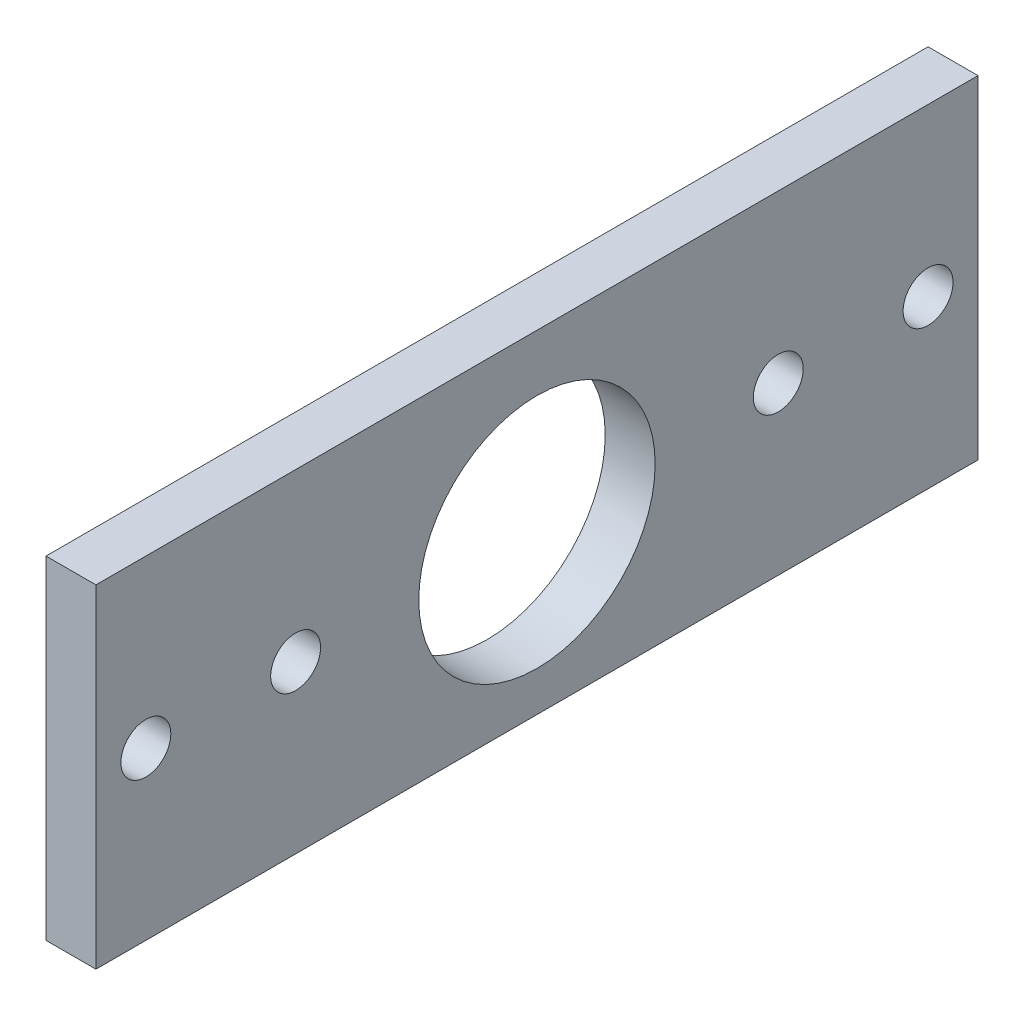
ISO-10303-21;
HEADER;
FILE_DESCRIPTION(('STEP AP214'),'2;1');
FILE_NAME('part.step','',(''),(''),'','','');
FILE_SCHEMA(('AUTOMOTIVE_DESIGN { 1 0 10303 214 1 1 1 1 }'));
ENDSEC;
DATA;
#1=APPLICATION_CONTEXT('core data for automotive mechanical design processes');
#2=APPLICATION_PROTOCOL_DEFINITION('international standard','automotive_design',2000,#1);
#3=PRODUCT_CONTEXT('',#1,'mechanical');
#4=PRODUCT('Part','Part','',(#3));
#5=PRODUCT_RELATED_PRODUCT_CATEGORY('part','',(#4));
#6=PRODUCT_DEFINITION_FORMATION('','',#4);
#7=PRODUCT_DEFINITION_CONTEXT('part definition',#1,'design');
#8=PRODUCT_DEFINITION('design','',#6,#7);
#9=PRODUCT_DEFINITION_SHAPE('','',#8);
#10=(LENGTH_UNIT() NAMED_UNIT(*) SI_UNIT(.MILLI.,.METRE.));
#11=(NAMED_UNIT(*) PLANE_ANGLE_UNIT() SI_UNIT($,.RADIAN.));
#12=(NAMED_UNIT(*) SI_UNIT($,.STERADIAN.) SOLID_ANGLE_UNIT());
#13=UNCERTAINTY_MEASURE_WITH_UNIT(LENGTH_MEASURE(1.E-05),#10,'distance_accuracy_value','');
#14=(GEOMETRIC_REPRESENTATION_CONTEXT(3) GLOBAL_UNCERTAINTY_ASSIGNED_CONTEXT((#13)) GLOBAL_UNIT_ASSIGNED_CONTEXT((#10,
#11,#12)) REPRESENTATION_CONTEXT('',''));
#15=CARTESIAN_POINT('',(0.,0.,0.));
#16=DIRECTION('',(0.,0.,1.));
#17=DIRECTION('',(1.,0.,0.));
#18=AXIS2_PLACEMENT_3D('',#15,#16,#17);
#19=CARTESIAN_POINT('',(3.,0.,0.));
#20=DIRECTION('',(-1.,0.,0.));
#21=DIRECTION('',(0.,0.,1.));
#22=AXIS2_PLACEMENT_3D('',#19,#20,#21);
#23=PLANE('',#22);
#24=DIRECTION('',(0.,-1.,0.));
#25=VECTOR('',#24,1.);
#26=CARTESIAN_POINT('',(3.,0.,0.));
#27=LINE('',#26,#25);
#28=CARTESIAN_POINT('',(3.,20.,0.));
#29=VERTEX_POINT('',#28);
#30=CARTESIAN_POINT('',(3.,0.,0.));
#31=VERTEX_POINT('',#30);
#32=EDGE_CURVE('E87',#29,#31,#27,.T.);
#33=ORIENTED_EDGE('',*,*,#32,.T.);
#34=DIRECTION('',(0.,0.,-1.));
#35=VECTOR('',#34,1.);
#36=CARTESIAN_POINT('',(3.,0.,0.));
#37=LINE('',#36,#35);
#38=CARTESIAN_POINT('',(3.,0.,-53.));
#39=VERTEX_POINT('',#38);
#40=EDGE_CURVE('E82',#31,#39,#37,.T.);
#41=ORIENTED_EDGE('',*,*,#40,.T.);
#42=DIRECTION('',(0.,1.,0.));
#43=VECTOR('',#42,1.);
#44=CARTESIAN_POINT('',(3.,0.,-53.));
#45=LINE('',#44,#43);
#46=CARTESIAN_POINT('',(3.,20.,-53.));
#47=VERTEX_POINT('',#46);
#48=EDGE_CURVE('E85',#39,#47,#45,.T.);
#49=ORIENTED_EDGE('',*,*,#48,.T.);
#50=DIRECTION('',(0.,0.,1.));
#51=VECTOR('',#50,1.);
#52=CARTESIAN_POINT('',(3.,20.,0.));
#53=LINE('',#52,#51);
#54=EDGE_CURVE('E52',#47,#29,#53,.T.);
#55=ORIENTED_EDGE('',*,*,#54,.T.);
#56=EDGE_LOOP('',(#33,#41,#49,#55));
#57=FACE_BOUND('',#56,.T.);
#58=CARTESIAN_POINT('',(3.,10.,-3.));
#59=DIRECTION('',(1.,0.,0.));
#60=DIRECTION('',(0.,0.,-1.));
#61=AXIS2_PLACEMENT_3D('',#58,#59,#60);
#62=CIRCLE('',#61,1.5);
#63=CARTESIAN_POINT('',(3.,10.,-4.5));
#64=VERTEX_POINT('',#63);
#65=EDGE_CURVE('E102',#64,#64,#62,.T.);
#66=ORIENTED_EDGE('',*,*,#65,.F.);
#67=EDGE_LOOP('',(#66));
#68=FACE_BOUND('',#67,.T.);
#69=CARTESIAN_POINT('',(3.,10.,-12.));
#70=DIRECTION('',(1.,0.,0.));
#71=DIRECTION('',(0.,0.,-1.));
#72=AXIS2_PLACEMENT_3D('',#69,#70,#71);
#73=CIRCLE('',#72,1.5);
#74=CARTESIAN_POINT('',(3.,10.,-13.5));
#75=VERTEX_POINT('',#74);
#76=EDGE_CURVE('E117',#75,#75,#73,.T.);
#77=ORIENTED_EDGE('',*,*,#76,.F.);
#78=EDGE_LOOP('',(#77));
#79=FACE_BOUND('',#78,.T.);
#80=CARTESIAN_POINT('',(3.,9.5,-26.5));
#81=DIRECTION('',(1.,0.,0.));
#82=DIRECTION('',(0.,0.,-1.));
#83=AXIS2_PLACEMENT_3D('',#80,#81,#82);
#84=CIRCLE('',#83,7.10183023594653);
#85=CARTESIAN_POINT('',(3.,9.5,-33.6018302359465));
#86=VERTEX_POINT('',#85);
#87=EDGE_CURVE('E123',#86,#86,#84,.T.);
#88=ORIENTED_EDGE('',*,*,#87,.F.);
#89=EDGE_LOOP('',(#88));
#90=FACE_BOUND('',#89,.T.);
#91=CARTESIAN_POINT('',(3.,10.,-41.));
#92=DIRECTION('',(1.,0.,0.));
#93=DIRECTION('',(0.,0.,1.));
#94=AXIS2_PLACEMENT_3D('',#91,#92,#93);
#95=CIRCLE('',#94,1.5);
#96=CARTESIAN_POINT('',(3.,10.,-39.5));
#97=VERTEX_POINT('',#96);
#98=EDGE_CURVE('E129',#97,#97,#95,.T.);
#99=ORIENTED_EDGE('',*,*,#98,.F.);
#100=EDGE_LOOP('',(#99));
#101=FACE_BOUND('',#100,.T.);
#102=CARTESIAN_POINT('',(3.,10.,-50.));
#103=DIRECTION('',(1.,0.,0.));
#104=DIRECTION('',(0.,0.,1.));
#105=AXIS2_PLACEMENT_3D('',#102,#103,#104);
#106=CIRCLE('',#105,1.5);
#107=CARTESIAN_POINT('',(3.,10.,-48.5));
#108=VERTEX_POINT('',#107);
#109=EDGE_CURVE('E135',#108,#108,#106,.T.);
#110=ORIENTED_EDGE('',*,*,#109,.F.);
#111=EDGE_LOOP('',(#110));
#112=FACE_BOUND('',#111,.T.);
#113=ADVANCED_FACE('F35',(#57,#68,#79,#90,#101,#112),#23,.F.);
#114=CARTESIAN_POINT('',(0.,0.,0.));
#115=DIRECTION('',(-1.,0.,0.));
#116=DIRECTION('',(0.,0.,1.));
#117=AXIS2_PLACEMENT_3D('',#114,#115,#116);
#118=PLANE('',#117);
#119=CARTESIAN_POINT('',(0.,10.,-41.));
#120=DIRECTION('',(1.,0.,0.));
#121=DIRECTION('',(0.,0.,1.));
#122=AXIS2_PLACEMENT_3D('',#119,#120,#121);
#123=CIRCLE('',#122,1.5);
#124=CARTESIAN_POINT('',(0.,10.,-39.5));
#125=VERTEX_POINT('',#124);
#126=EDGE_CURVE('E132',#125,#125,#123,.T.);
#127=ORIENTED_EDGE('',*,*,#126,.T.);
#128=EDGE_LOOP('',(#127));
#129=FACE_BOUND('',#128,.T.);
#130=CARTESIAN_POINT('',(0.,10.,-12.));
#131=DIRECTION('',(1.,0.,0.));
#132=DIRECTION('',(0.,0.,-1.));
#133=AXIS2_PLACEMENT_3D('',#130,#131,#132);
#134=CIRCLE('',#133,1.5);
#135=CARTESIAN_POINT('',(0.,10.,-13.5));
#136=VERTEX_POINT('',#135);
#137=EDGE_CURVE('E120',#136,#136,#134,.T.);
#138=ORIENTED_EDGE('',*,*,#137,.T.);
#139=EDGE_LOOP('',(#138));
#140=FACE_BOUND('',#139,.T.);
#141=DIRECTION('',(0.,-1.,0.));
#142=VECTOR('',#141,1.);
#143=CARTESIAN_POINT('',(0.,0.,0.));
#144=LINE('',#143,#142);
#145=CARTESIAN_POINT('',(0.,20.,0.));
#146=VERTEX_POINT('',#145);
#147=CARTESIAN_POINT('',(0.,0.,0.));
#148=VERTEX_POINT('',#147);
#149=EDGE_CURVE('E99',#146,#148,#144,.T.);
#150=ORIENTED_EDGE('',*,*,#149,.F.);
#151=DIRECTION('',(0.,0.,1.));
#152=VECTOR('',#151,1.);
#153=CARTESIAN_POINT('',(0.,20.,0.));
#154=LINE('',#153,#152);
#155=CARTESIAN_POINT('',(0.,20.,-53.));
#156=VERTEX_POINT('',#155);
#157=EDGE_CURVE('E75',#156,#146,#154,.T.);
#158=ORIENTED_EDGE('',*,*,#157,.F.);
#159=DIRECTION('',(0.,1.,0.));
#160=VECTOR('',#159,1.);
#161=CARTESIAN_POINT('',(0.,0.,-53.));
#162=LINE('',#161,#160);
#163=CARTESIAN_POINT('',(0.,0.,-53.));
#164=VERTEX_POINT('',#163);
#165=EDGE_CURVE('E69',#164,#156,#162,.T.);
#166=ORIENTED_EDGE('',*,*,#165,.F.);
#167=DIRECTION('',(0.,0.,-1.));
#168=VECTOR('',#167,1.);
#169=CARTESIAN_POINT('',(0.,0.,0.));
#170=LINE('',#169,#168);
#171=EDGE_CURVE('E91',#148,#164,#170,.T.);
#172=ORIENTED_EDGE('',*,*,#171,.F.);
#173=EDGE_LOOP('',(#150,#158,#166,#172));
#174=FACE_BOUND('',#173,.T.);
#175=CARTESIAN_POINT('',(0.,10.,-3.));
#176=DIRECTION('',(1.,0.,0.));
#177=DIRECTION('',(0.,0.,-1.));
#178=AXIS2_PLACEMENT_3D('',#175,#176,#177);
#179=CIRCLE('',#178,1.5);
#180=CARTESIAN_POINT('',(0.,10.,-4.5));
#181=VERTEX_POINT('',#180);
#182=EDGE_CURVE('E114',#181,#181,#179,.T.);
#183=ORIENTED_EDGE('',*,*,#182,.T.);
#184=EDGE_LOOP('',(#183));
#185=FACE_BOUND('',#184,.T.);
#186=CARTESIAN_POINT('',(0.,9.5,-26.5));
#187=DIRECTION('',(1.,0.,0.));
#188=DIRECTION('',(0.,0.,-1.));
#189=AXIS2_PLACEMENT_3D('',#186,#187,#188);
#190=CIRCLE('',#189,7.10183023594653);
#191=CARTESIAN_POINT('',(0.,9.5,-33.6018302359465));
#192=VERTEX_POINT('',#191);
#193=EDGE_CURVE('E126',#192,#192,#190,.T.);
#194=ORIENTED_EDGE('',*,*,#193,.T.);
#195=EDGE_LOOP('',(#194));
#196=FACE_BOUND('',#195,.T.);
#197=CARTESIAN_POINT('',(0.,10.,-50.));
#198=DIRECTION('',(1.,0.,0.));
#199=DIRECTION('',(0.,0.,1.));
#200=AXIS2_PLACEMENT_3D('',#197,#198,#199);
#201=CIRCLE('',#200,1.5);
#202=CARTESIAN_POINT('',(0.,10.,-48.5));
#203=VERTEX_POINT('',#202);
#204=EDGE_CURVE('E138',#203,#203,#201,.T.);
#205=ORIENTED_EDGE('',*,*,#204,.T.);
#206=EDGE_LOOP('',(#205));
#207=FACE_BOUND('',#206,.T.);
#208=ADVANCED_FACE('F110',(#129,#140,#174,#185,#196,#207),#118,.T.);
#209=CARTESIAN_POINT('',(3.,0.,0.));
#210=DIRECTION('',(0.,0.,-1.));
#211=DIRECTION('',(-1.,0.,0.));
#212=AXIS2_PLACEMENT_3D('',#209,#210,#211);
#213=PLANE('',#212);
#214=ORIENTED_EDGE('',*,*,#149,.T.);
#215=DIRECTION('',(-1.,0.,0.));
#216=VECTOR('',#215,1.);
#217=CARTESIAN_POINT('',(3.,0.,0.));
#218=LINE('',#217,#216);
#219=EDGE_CURVE('E11',#31,#148,#218,.T.);
#220=ORIENTED_EDGE('',*,*,#219,.F.);
#221=ORIENTED_EDGE('',*,*,#32,.F.);
#222=DIRECTION('',(-1.,0.,0.));
#223=VECTOR('',#222,1.);
#224=CARTESIAN_POINT('',(3.,20.,0.));
#225=LINE('',#224,#223);
#226=EDGE_CURVE('E95',#29,#146,#225,.T.);
#227=ORIENTED_EDGE('',*,*,#226,.T.);
#228=EDGE_LOOP('',(#214,#220,#221,#227));
#229=FACE_BOUND('',#228,.T.);
#230=ADVANCED_FACE('F37',(#229),#213,.F.);
#231=CARTESIAN_POINT('',(3.,0.,0.));
#232=DIRECTION('',(0.,1.,0.));
#233=DIRECTION('',(0.,0.,1.));
#234=AXIS2_PLACEMENT_3D('',#231,#232,#233);
#235=PLANE('',#234);
#236=ORIENTED_EDGE('',*,*,#171,.T.);
#237=DIRECTION('',(-1.,0.,0.));
#238=VECTOR('',#237,1.);
#239=CARTESIAN_POINT('',(3.,0.,-53.));
#240=LINE('',#239,#238);
#241=EDGE_CURVE('E44',#39,#164,#240,.T.);
#242=ORIENTED_EDGE('',*,*,#241,.F.);
#243=ORIENTED_EDGE('',*,*,#40,.F.);
#244=ORIENTED_EDGE('',*,*,#219,.T.);
#245=EDGE_LOOP('',(#236,#242,#243,#244));
#246=FACE_BOUND('',#245,.T.);
#247=ADVANCED_FACE('F90',(#246),#235,.F.);
#248=CARTESIAN_POINT('',(3.,0.,-53.));
#249=DIRECTION('',(0.,0.,1.));
#250=DIRECTION('',(1.,0.,0.));
#251=AXIS2_PLACEMENT_3D('',#248,#249,#250);
#252=PLANE('',#251);
#253=ORIENTED_EDGE('',*,*,#165,.T.);
#254=DIRECTION('',(-1.,0.,0.));
#255=VECTOR('',#254,1.);
#256=CARTESIAN_POINT('',(3.,20.,-53.));
#257=LINE('',#256,#255);
#258=EDGE_CURVE('E92',#47,#156,#257,.T.);
#259=ORIENTED_EDGE('',*,*,#258,.F.);
#260=ORIENTED_EDGE('',*,*,#48,.F.);
#261=ORIENTED_EDGE('',*,*,#241,.T.);
#262=EDGE_LOOP('',(#253,#259,#260,#261));
#263=FACE_BOUND('',#262,.T.);
#264=ADVANCED_FACE('F93',(#263),#252,.F.);
#265=CARTESIAN_POINT('',(3.,20.,0.));
#266=DIRECTION('',(0.,-1.,0.));
#267=DIRECTION('',(0.,0.,-1.));
#268=AXIS2_PLACEMENT_3D('',#265,#266,#267);
#269=PLANE('',#268);
#270=ORIENTED_EDGE('',*,*,#157,.T.);
#271=ORIENTED_EDGE('',*,*,#226,.F.);
#272=ORIENTED_EDGE('',*,*,#54,.F.);
#273=ORIENTED_EDGE('',*,*,#258,.T.);
#274=EDGE_LOOP('',(#270,#271,#272,#273));
#275=FACE_BOUND('',#274,.T.);
#276=ADVANCED_FACE('F107',(#275),#269,.F.);
#277=CARTESIAN_POINT('',(3.,10.,-3.));
#278=DIRECTION('',(-1.,0.,0.));
#279=DIRECTION('',(0.,0.,1.));
#280=AXIS2_PLACEMENT_3D('',#277,#278,#279);
#281=CYLINDRICAL_SURFACE('',#280,1.5);
#282=ORIENTED_EDGE('',*,*,#65,.T.);
#283=EDGE_LOOP('',(#282));
#284=FACE_BOUND('',#283,.T.);
#285=ORIENTED_EDGE('',*,*,#182,.F.);
#286=EDGE_LOOP('',(#285));
#287=FACE_BOUND('',#286,.T.);
#288=ADVANCED_FACE('F155',(#284,#287),#281,.F.);
#289=CARTESIAN_POINT('',(3.,10.,-12.));
#290=DIRECTION('',(-1.,0.,0.));
#291=DIRECTION('',(0.,0.,1.));
#292=AXIS2_PLACEMENT_3D('',#289,#290,#291);
#293=CYLINDRICAL_SURFACE('',#292,1.5);
#294=ORIENTED_EDGE('',*,*,#76,.T.);
#295=EDGE_LOOP('',(#294));
#296=FACE_BOUND('',#295,.T.);
#297=ORIENTED_EDGE('',*,*,#137,.F.);
#298=EDGE_LOOP('',(#297));
#299=FACE_BOUND('',#298,.T.);
#300=ADVANCED_FACE('F201',(#296,#299),#293,.F.);
#301=CARTESIAN_POINT('',(3.,9.5,-26.5));
#302=DIRECTION('',(-1.,0.,0.));
#303=DIRECTION('',(0.,0.,1.));
#304=AXIS2_PLACEMENT_3D('',#301,#302,#303);
#305=CYLINDRICAL_SURFACE('',#304,7.10183023594653);
#306=ORIENTED_EDGE('',*,*,#87,.T.);
#307=EDGE_LOOP('',(#306));
#308=FACE_BOUND('',#307,.T.);
#309=ORIENTED_EDGE('',*,*,#193,.F.);
#310=EDGE_LOOP('',(#309));
#311=FACE_BOUND('',#310,.T.);
#312=ADVANCED_FACE('F209',(#308,#311),#305,.F.);
#313=CARTESIAN_POINT('',(3.,10.,-41.));
#314=DIRECTION('',(-1.,0.,0.));
#315=DIRECTION('',(0.,0.,1.));
#316=AXIS2_PLACEMENT_3D('',#313,#314,#315);
#317=CYLINDRICAL_SURFACE('',#316,1.5);
#318=ORIENTED_EDGE('',*,*,#98,.T.);
#319=EDGE_LOOP('',(#318));
#320=FACE_BOUND('',#319,.T.);
#321=ORIENTED_EDGE('',*,*,#126,.F.);
#322=EDGE_LOOP('',(#321));
#323=FACE_BOUND('',#322,.T.);
#324=ADVANCED_FACE('F217',(#320,#323),#317,.F.);
#325=CARTESIAN_POINT('',(3.,10.,-50.));
#326=DIRECTION('',(-1.,0.,0.));
#327=DIRECTION('',(0.,0.,1.));
#328=AXIS2_PLACEMENT_3D('',#325,#326,#327);
#329=CYLINDRICAL_SURFACE('',#328,1.5);
#330=ORIENTED_EDGE('',*,*,#109,.T.);
#331=EDGE_LOOP('',(#330));
#332=FACE_BOUND('',#331,.T.);
#333=ORIENTED_EDGE('',*,*,#204,.F.);
#334=EDGE_LOOP('',(#333));
#335=FACE_BOUND('',#334,.T.);
#336=ADVANCED_FACE('F144',(#332,#335),#329,.F.);
#337=CLOSED_SHELL('',(#113,#208,#230,#247,#264,#276,#288,#300,#312,#324,#336));
#338=MANIFOLD_SOLID_BREP('B2',#337);
#339=ADVANCED_BREP_SHAPE_REPRESENTATION('',(#18,#338),#14);
#340=SHAPE_DEFINITION_REPRESENTATION(#9,#339);
ENDSEC;
END-ISO-10303-21;
